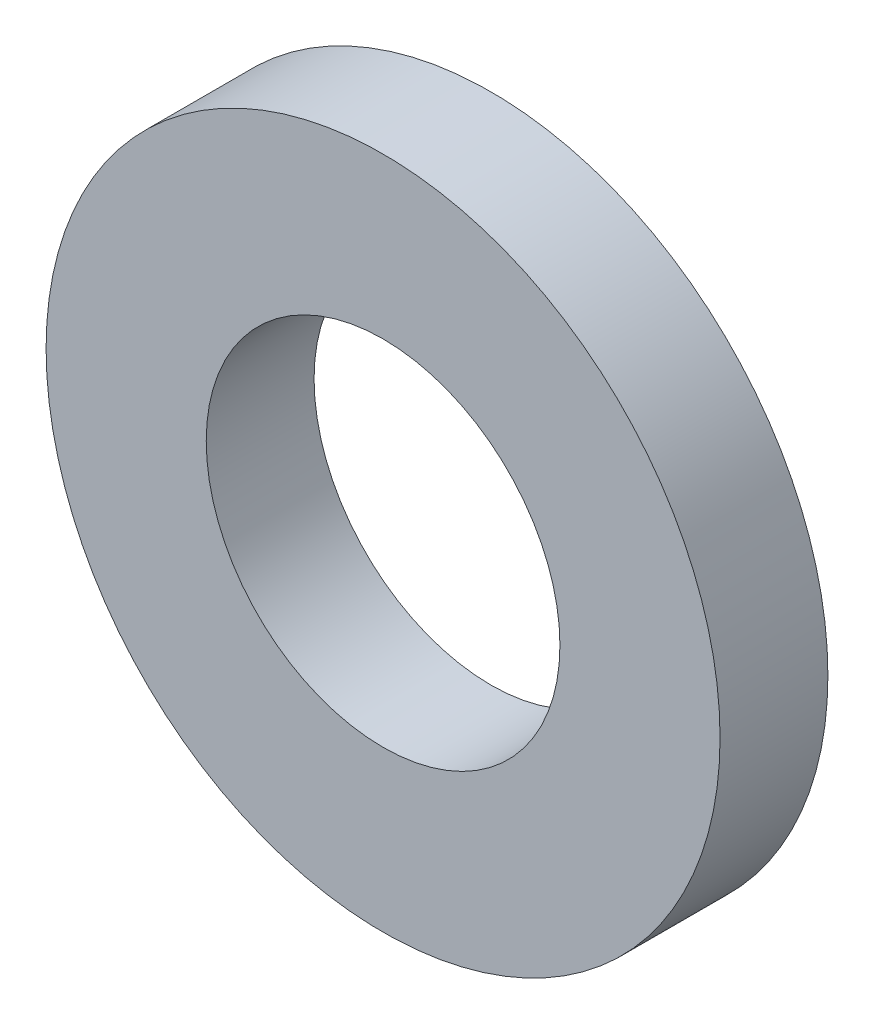
ISO-10303-21;
HEADER;
FILE_DESCRIPTION(('STEP AP214'),'2;1');
FILE_NAME('part.step','',(''),(''),'','','');
FILE_SCHEMA(('AUTOMOTIVE_DESIGN { 1 0 10303 214 1 1 1 1 }'));
ENDSEC;
DATA;
#1=APPLICATION_CONTEXT('core data for automotive mechanical design processes');
#2=APPLICATION_PROTOCOL_DEFINITION('international standard','automotive_design',2000,#1);
#3=PRODUCT_CONTEXT('',#1,'mechanical');
#4=PRODUCT('Part','Part','',(#3));
#5=PRODUCT_RELATED_PRODUCT_CATEGORY('part','',(#4));
#6=PRODUCT_DEFINITION_FORMATION('','',#4);
#7=PRODUCT_DEFINITION_CONTEXT('part definition',#1,'design');
#8=PRODUCT_DEFINITION('design','',#6,#7);
#9=PRODUCT_DEFINITION_SHAPE('','',#8);
#10=(LENGTH_UNIT() NAMED_UNIT(*) SI_UNIT(.MILLI.,.METRE.));
#11=(NAMED_UNIT(*) PLANE_ANGLE_UNIT() SI_UNIT($,.RADIAN.));
#12=(NAMED_UNIT(*) SI_UNIT($,.STERADIAN.) SOLID_ANGLE_UNIT());
#13=UNCERTAINTY_MEASURE_WITH_UNIT(LENGTH_MEASURE(1.E-05),#10,'distance_accuracy_value','');
#14=(GEOMETRIC_REPRESENTATION_CONTEXT(3) GLOBAL_UNCERTAINTY_ASSIGNED_CONTEXT((#13)) GLOBAL_UNIT_ASSIGNED_CONTEXT((#10,
#11,#12)) REPRESENTATION_CONTEXT('',''));
#15=CARTESIAN_POINT('',(0.,0.,0.));
#16=DIRECTION('',(0.,0.,1.));
#17=DIRECTION('',(1.,0.,0.));
#18=AXIS2_PLACEMENT_3D('',#15,#16,#17);
#19=CARTESIAN_POINT('',(0.,0.,-1.27));
#20=DIRECTION('',(0.,0.,1.));
#21=DIRECTION('',(1.,0.,0.));
#22=AXIS2_PLACEMENT_3D('',#19,#20,#21);
#23=CYLINDRICAL_SURFACE('',#22,3.96875);
#24=CARTESIAN_POINT('',(0.,0.,-1.27));
#25=DIRECTION('',(0.,0.,1.));
#26=DIRECTION('',(1.,0.,0.));
#27=AXIS2_PLACEMENT_3D('',#24,#25,#26);
#28=CIRCLE('',#27,3.96875);
#29=CARTESIAN_POINT('',(3.96875,0.,-1.27));
#30=VERTEX_POINT('',#29);
#31=EDGE_CURVE('E10',#30,#30,#28,.T.);
#32=ORIENTED_EDGE('',*,*,#31,.T.);
#33=EDGE_LOOP('',(#32));
#34=FACE_BOUND('',#33,.T.);
#35=CARTESIAN_POINT('',(0.,0.,0.));
#36=DIRECTION('',(0.,0.,1.));
#37=DIRECTION('',(1.,0.,0.));
#38=AXIS2_PLACEMENT_3D('',#35,#36,#37);
#39=CIRCLE('',#38,3.96875);
#40=CARTESIAN_POINT('',(3.96875,0.,0.));
#41=VERTEX_POINT('',#40);
#42=EDGE_CURVE('E33',#41,#41,#39,.T.);
#43=ORIENTED_EDGE('',*,*,#42,.F.);
#44=EDGE_LOOP('',(#43));
#45=FACE_BOUND('',#44,.T.);
#46=ADVANCED_FACE('F30',(#34,#45),#23,.T.);
#47=CARTESIAN_POINT('',(0.,0.,-1.27));
#48=DIRECTION('',(0.,0.,1.));
#49=DIRECTION('',(1.,0.,0.));
#50=AXIS2_PLACEMENT_3D('',#47,#48,#49);
#51=PLANE('',#50);
#52=CARTESIAN_POINT('',(0.,0.,-1.27));
#53=DIRECTION('',(0.,0.,1.));
#54=DIRECTION('',(1.,0.,0.));
#55=AXIS2_PLACEMENT_3D('',#52,#53,#54);
#56=CIRCLE('',#55,2.0828);
#57=CARTESIAN_POINT('',(2.0828,0.,-1.27));
#58=VERTEX_POINT('',#57);
#59=EDGE_CURVE('E40',#58,#58,#56,.T.);
#60=ORIENTED_EDGE('',*,*,#59,.T.);
#61=EDGE_LOOP('',(#60));
#62=FACE_BOUND('',#61,.T.);
#63=ORIENTED_EDGE('',*,*,#31,.F.);
#64=EDGE_LOOP('',(#63));
#65=FACE_BOUND('',#64,.T.);
#66=ADVANCED_FACE('F48',(#62,#65),#51,.F.);
#67=CARTESIAN_POINT('',(0.,0.,0.));
#68=DIRECTION('',(0.,0.,1.));
#69=DIRECTION('',(1.,0.,0.));
#70=AXIS2_PLACEMENT_3D('',#67,#68,#69);
#71=PLANE('',#70);
#72=CARTESIAN_POINT('',(0.,0.,0.));
#73=DIRECTION('',(0.,0.,1.));
#74=DIRECTION('',(1.,0.,0.));
#75=AXIS2_PLACEMENT_3D('',#72,#73,#74);
#76=CIRCLE('',#75,2.0828);
#77=CARTESIAN_POINT('',(2.0828,0.,0.));
#78=VERTEX_POINT('',#77);
#79=EDGE_CURVE('E42',#78,#78,#76,.T.);
#80=ORIENTED_EDGE('',*,*,#79,.F.);
#81=EDGE_LOOP('',(#80));
#82=FACE_BOUND('',#81,.T.);
#83=ORIENTED_EDGE('',*,*,#42,.T.);
#84=EDGE_LOOP('',(#83));
#85=FACE_BOUND('',#84,.T.);
#86=ADVANCED_FACE('F54',(#82,#85),#71,.T.);
#87=CARTESIAN_POINT('',(0.,0.,-1.27));
#88=DIRECTION('',(0.,0.,1.));
#89=DIRECTION('',(1.,0.,0.));
#90=AXIS2_PLACEMENT_3D('',#87,#88,#89);
#91=CYLINDRICAL_SURFACE('',#90,2.0828);
#92=ORIENTED_EDGE('',*,*,#59,.F.);
#93=EDGE_LOOP('',(#92));
#94=FACE_BOUND('',#93,.T.);
#95=ORIENTED_EDGE('',*,*,#79,.T.);
#96=EDGE_LOOP('',(#95));
#97=FACE_BOUND('',#96,.T.);
#98=ADVANCED_FACE('F51',(#94,#97),#91,.F.);
#99=CLOSED_SHELL('',(#46,#66,#86,#98));
#100=MANIFOLD_SOLID_BREP('B2',#99);
#101=ADVANCED_BREP_SHAPE_REPRESENTATION('',(#18,#100),#14);
#102=SHAPE_DEFINITION_REPRESENTATION(#9,#101);
ENDSEC;
END-ISO-10303-21;
